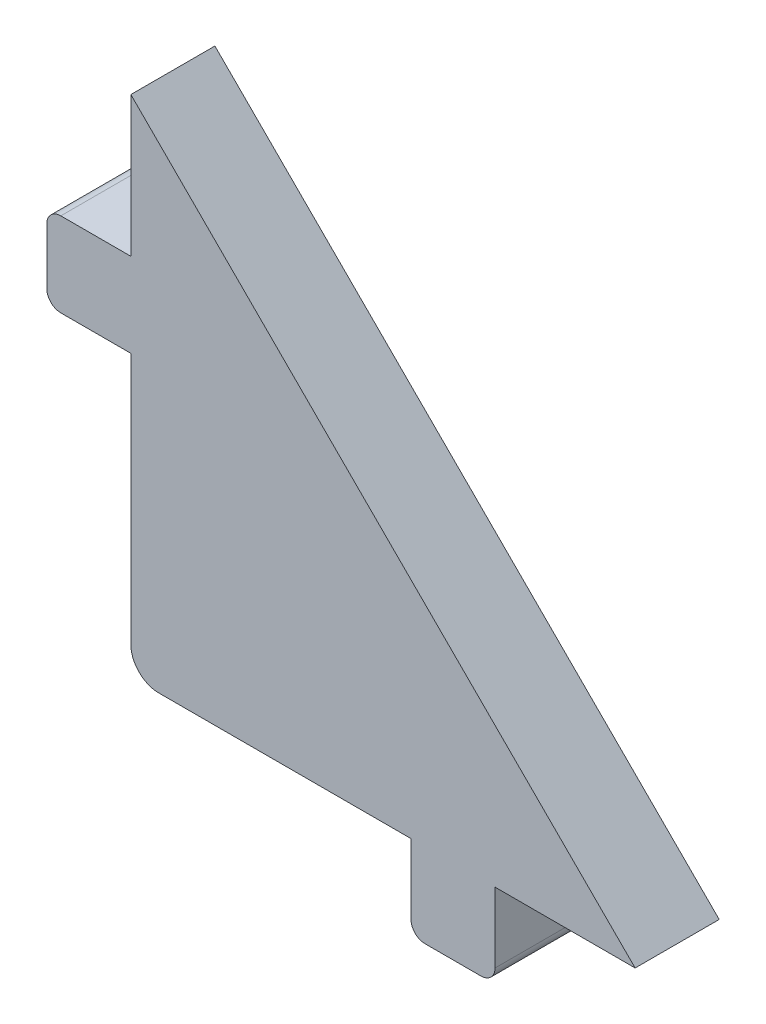
ISO-10303-21;
HEADER;
FILE_DESCRIPTION(('STEP AP214'),'2;1');
FILE_NAME('part.step','',(''),(''),'','','');
FILE_SCHEMA(('AUTOMOTIVE_DESIGN { 1 0 10303 214 1 1 1 1 }'));
ENDSEC;
DATA;
#1=APPLICATION_CONTEXT('core data for automotive mechanical design processes');
#2=APPLICATION_PROTOCOL_DEFINITION('international standard','automotive_design',2000,#1);
#3=PRODUCT_CONTEXT('',#1,'mechanical');
#4=PRODUCT('Part','Part','',(#3));
#5=PRODUCT_RELATED_PRODUCT_CATEGORY('part','',(#4));
#6=PRODUCT_DEFINITION_FORMATION('','',#4);
#7=PRODUCT_DEFINITION_CONTEXT('part definition',#1,'design');
#8=PRODUCT_DEFINITION('design','',#6,#7);
#9=PRODUCT_DEFINITION_SHAPE('','',#8);
#10=(LENGTH_UNIT() NAMED_UNIT(*) SI_UNIT(.MILLI.,.METRE.));
#11=(NAMED_UNIT(*) PLANE_ANGLE_UNIT() SI_UNIT($,.RADIAN.));
#12=(NAMED_UNIT(*) SI_UNIT($,.STERADIAN.) SOLID_ANGLE_UNIT());
#13=UNCERTAINTY_MEASURE_WITH_UNIT(LENGTH_MEASURE(1.E-05),#10,'distance_accuracy_value','');
#14=(GEOMETRIC_REPRESENTATION_CONTEXT(3) GLOBAL_UNCERTAINTY_ASSIGNED_CONTEXT((#13)) GLOBAL_UNIT_ASSIGNED_CONTEXT((#10,
#11,#12)) REPRESENTATION_CONTEXT('',''));
#15=CARTESIAN_POINT('',(0.,0.,0.));
#16=DIRECTION('',(0.,0.,1.));
#17=DIRECTION('',(1.,0.,0.));
#18=AXIS2_PLACEMENT_3D('',#15,#16,#17);
#19=CARTESIAN_POINT('',(0.,0.,3.));
#20=DIRECTION('',(0.,-1.,0.));
#21=DIRECTION('',(1.,0.,0.));
#22=AXIS2_PLACEMENT_3D('',#19,#20,#21);
#23=PLANE('',#22);
#24=DIRECTION('',(-1.,0.,0.));
#25=VECTOR('',#24,1.);
#26=CARTESIAN_POINT('',(0.,0.,3.));
#27=LINE('',#26,#25);
#28=CARTESIAN_POINT('',(3.,0.,3.));
#29=VERTEX_POINT('',#28);
#30=CARTESIAN_POINT('',(0.5,0.,3.));
#31=VERTEX_POINT('',#30);
#32=EDGE_CURVE('E160',#29,#31,#27,.T.);
#33=ORIENTED_EDGE('',*,*,#32,.T.);
#34=DIRECTION('',(0.,0.,-1.));
#35=VECTOR('',#34,1.);
#36=CARTESIAN_POINT('',(0.5,0.,3.));
#37=LINE('',#36,#35);
#38=CARTESIAN_POINT('',(0.5,0.,0.));
#39=VERTEX_POINT('',#38);
#40=EDGE_CURVE('E297',#31,#39,#37,.T.);
#41=ORIENTED_EDGE('',*,*,#40,.T.);
#42=DIRECTION('',(-1.,0.,0.));
#43=VECTOR('',#42,1.);
#44=CARTESIAN_POINT('',(0.,0.,0.));
#45=LINE('',#44,#43);
#46=CARTESIAN_POINT('',(3.,0.,0.));
#47=VERTEX_POINT('',#46);
#48=EDGE_CURVE('E167',#47,#39,#45,.T.);
#49=ORIENTED_EDGE('',*,*,#48,.F.);
#50=DIRECTION('',(0.,0.,-1.));
#51=VECTOR('',#50,1.);
#52=CARTESIAN_POINT('',(3.,0.,3.));
#53=LINE('',#52,#51);
#54=EDGE_CURVE('E153',#29,#47,#53,.T.);
#55=ORIENTED_EDGE('',*,*,#54,.F.);
#56=EDGE_LOOP('',(#33,#41,#49,#55));
#57=FACE_BOUND('',#56,.T.);
#58=ADVANCED_FACE('F40',(#57),#23,.T.);
#59=CARTESIAN_POINT('',(3.,0.,3.));
#60=DIRECTION('',(-1.,0.,0.));
#61=DIRECTION('',(0.,0.,1.));
#62=AXIS2_PLACEMENT_3D('',#59,#60,#61);
#63=PLANE('',#62);
#64=DIRECTION('',(0.,1.,0.));
#65=VECTOR('',#64,1.);
#66=CARTESIAN_POINT('',(3.,0.,0.));
#67=LINE('',#66,#65);
#68=CARTESIAN_POINT('',(3.,-9.,0.));
#69=VERTEX_POINT('',#68);
#70=EDGE_CURVE('E219',#69,#47,#67,.T.);
#71=ORIENTED_EDGE('',*,*,#70,.F.);
#72=DIRECTION('',(0.,0.,-1.));
#73=VECTOR('',#72,1.);
#74=CARTESIAN_POINT('',(3.,-9.,3.));
#75=LINE('',#74,#73);
#76=CARTESIAN_POINT('',(3.,-9.,3.));
#77=VERTEX_POINT('',#76);
#78=EDGE_CURVE('E49',#69,#77,#75,.F.);
#79=ORIENTED_EDGE('',*,*,#78,.T.);
#80=DIRECTION('',(0.,1.,0.));
#81=VECTOR('',#80,1.);
#82=CARTESIAN_POINT('',(3.,0.,3.));
#83=LINE('',#82,#81);
#84=EDGE_CURVE('E150',#77,#29,#83,.T.);
#85=ORIENTED_EDGE('',*,*,#84,.T.);
#86=ORIENTED_EDGE('',*,*,#54,.T.);
#87=EDGE_LOOP('',(#71,#79,#85,#86));
#88=FACE_BOUND('',#87,.T.);
#89=ADVANCED_FACE('F152',(#88),#63,.T.);
#90=CARTESIAN_POINT('',(0.,-10.,3.));
#91=DIRECTION('',(0.,-1.,0.));
#92=DIRECTION('',(0.,0.,-1.));
#93=AXIS2_PLACEMENT_3D('',#90,#91,#92);
#94=PLANE('',#93);
#95=DIRECTION('',(-1.,0.,0.));
#96=VECTOR('',#95,1.);
#97=CARTESIAN_POINT('',(0.,-10.,3.));
#98=LINE('',#97,#96);
#99=CARTESIAN_POINT('',(13.,-10.,3.));
#100=VERTEX_POINT('',#99);
#101=CARTESIAN_POINT('',(4.,-10.,3.));
#102=VERTEX_POINT('',#101);
#103=EDGE_CURVE('E159',#100,#102,#98,.T.);
#104=ORIENTED_EDGE('',*,*,#103,.T.);
#105=DIRECTION('',(0.,0.,-1.));
#106=VECTOR('',#105,1.);
#107=CARTESIAN_POINT('',(4.,-10.,3.));
#108=LINE('',#107,#106);
#109=CARTESIAN_POINT('',(4.,-10.,0.));
#110=VERTEX_POINT('',#109);
#111=EDGE_CURVE('E314',#102,#110,#108,.T.);
#112=ORIENTED_EDGE('',*,*,#111,.T.);
#113=DIRECTION('',(-1.,0.,0.));
#114=VECTOR('',#113,1.);
#115=CARTESIAN_POINT('',(0.,-10.,0.));
#116=LINE('',#115,#114);
#117=CARTESIAN_POINT('',(13.,-10.,0.));
#118=VERTEX_POINT('',#117);
#119=EDGE_CURVE('E222',#118,#110,#116,.T.);
#120=ORIENTED_EDGE('',*,*,#119,.F.);
#121=DIRECTION('',(0.,0.,-1.));
#122=VECTOR('',#121,1.);
#123=CARTESIAN_POINT('',(13.,-10.,3.));
#124=LINE('',#123,#122);
#125=EDGE_CURVE('E170',#100,#118,#124,.T.);
#126=ORIENTED_EDGE('',*,*,#125,.F.);
#127=EDGE_LOOP('',(#104,#112,#120,#126));
#128=FACE_BOUND('',#127,.T.);
#129=ADVANCED_FACE('F323',(#128),#94,.T.);
#130=CARTESIAN_POINT('',(13.,0.,3.));
#131=DIRECTION('',(-1.,0.,0.));
#132=DIRECTION('',(0.,0.,1.));
#133=AXIS2_PLACEMENT_3D('',#130,#131,#132);
#134=PLANE('',#133);
#135=DIRECTION('',(0.,1.,0.));
#136=VECTOR('',#135,1.);
#137=CARTESIAN_POINT('',(13.,0.,0.));
#138=LINE('',#137,#136);
#139=CARTESIAN_POINT('',(13.,-12.5,0.));
#140=VERTEX_POINT('',#139);
#141=EDGE_CURVE('E225',#140,#118,#138,.T.);
#142=ORIENTED_EDGE('',*,*,#141,.F.);
#143=DIRECTION('',(0.,0.,-1.));
#144=VECTOR('',#143,1.);
#145=CARTESIAN_POINT('',(13.,-12.5,3.));
#146=LINE('',#145,#144);
#147=CARTESIAN_POINT('',(13.,-12.5,3.));
#148=VERTEX_POINT('',#147);
#149=EDGE_CURVE('E307',#140,#148,#146,.F.);
#150=ORIENTED_EDGE('',*,*,#149,.T.);
#151=DIRECTION('',(0.,1.,0.));
#152=VECTOR('',#151,1.);
#153=CARTESIAN_POINT('',(13.,0.,3.));
#154=LINE('',#153,#152);
#155=EDGE_CURVE('E187',#148,#100,#154,.T.);
#156=ORIENTED_EDGE('',*,*,#155,.T.);
#157=ORIENTED_EDGE('',*,*,#125,.T.);
#158=EDGE_LOOP('',(#142,#150,#156,#157));
#159=FACE_BOUND('',#158,.T.);
#160=ADVANCED_FACE('F331',(#159),#134,.T.);
#161=CARTESIAN_POINT('',(0.,-13.,3.));
#162=DIRECTION('',(0.,-1.,0.));
#163=DIRECTION('',(0.,0.,-1.));
#164=AXIS2_PLACEMENT_3D('',#161,#162,#163);
#165=PLANE('',#164);
#166=DIRECTION('',(-1.,0.,0.));
#167=VECTOR('',#166,1.);
#168=CARTESIAN_POINT('',(0.,-13.,3.));
#169=LINE('',#168,#167);
#170=CARTESIAN_POINT('',(15.5,-13.,3.));
#171=VERTEX_POINT('',#170);
#172=CARTESIAN_POINT('',(13.5,-13.,3.));
#173=VERTEX_POINT('',#172);
#174=EDGE_CURVE('E190',#171,#173,#169,.T.);
#175=ORIENTED_EDGE('',*,*,#174,.T.);
#176=DIRECTION('',(0.,0.,-1.));
#177=VECTOR('',#176,1.);
#178=CARTESIAN_POINT('',(13.5,-13.,3.));
#179=LINE('',#178,#177);
#180=CARTESIAN_POINT('',(13.5,-13.,0.));
#181=VERTEX_POINT('',#180);
#182=EDGE_CURVE('E303',#173,#181,#179,.T.);
#183=ORIENTED_EDGE('',*,*,#182,.T.);
#184=DIRECTION('',(-1.,0.,0.));
#185=VECTOR('',#184,1.);
#186=CARTESIAN_POINT('',(0.,-13.,0.));
#187=LINE('',#186,#185);
#188=CARTESIAN_POINT('',(15.5,-13.,0.));
#189=VERTEX_POINT('',#188);
#190=EDGE_CURVE('E228',#189,#181,#187,.T.);
#191=ORIENTED_EDGE('',*,*,#190,.F.);
#192=DIRECTION('',(0.,0.,-1.));
#193=VECTOR('',#192,1.);
#194=CARTESIAN_POINT('',(15.5,-13.,3.));
#195=LINE('',#194,#193);
#196=EDGE_CURVE('E300',#189,#171,#195,.F.);
#197=ORIENTED_EDGE('',*,*,#196,.T.);
#198=EDGE_LOOP('',(#175,#183,#191,#197));
#199=FACE_BOUND('',#198,.T.);
#200=ADVANCED_FACE('F366',(#199),#165,.T.);
#201=CARTESIAN_POINT('',(16.,0.,3.));
#202=DIRECTION('',(1.,0.,0.));
#203=DIRECTION('',(0.,1.,0.));
#204=AXIS2_PLACEMENT_3D('',#201,#202,#203);
#205=PLANE('',#204);
#206=DIRECTION('',(0.,-1.,0.));
#207=VECTOR('',#206,1.);
#208=CARTESIAN_POINT('',(16.,0.,3.));
#209=LINE('',#208,#207);
#210=CARTESIAN_POINT('',(16.,-10.,3.));
#211=VERTEX_POINT('',#210);
#212=CARTESIAN_POINT('',(16.,-12.5,3.));
#213=VERTEX_POINT('',#212);
#214=EDGE_CURVE('E194',#211,#213,#209,.T.);
#215=ORIENTED_EDGE('',*,*,#214,.T.);
#216=DIRECTION('',(0.,0.,-1.));
#217=VECTOR('',#216,1.);
#218=CARTESIAN_POINT('',(16.,-12.5,3.));
#219=LINE('',#218,#217);
#220=CARTESIAN_POINT('',(16.,-12.5,0.));
#221=VERTEX_POINT('',#220);
#222=EDGE_CURVE('E310',#213,#221,#219,.T.);
#223=ORIENTED_EDGE('',*,*,#222,.T.);
#224=DIRECTION('',(0.,-1.,0.));
#225=VECTOR('',#224,1.);
#226=CARTESIAN_POINT('',(16.,0.,0.));
#227=LINE('',#226,#225);
#228=CARTESIAN_POINT('',(16.,-10.,0.));
#229=VERTEX_POINT('',#228);
#230=EDGE_CURVE('E232',#229,#221,#227,.T.);
#231=ORIENTED_EDGE('',*,*,#230,.F.);
#232=DIRECTION('',(0.,0.,-1.));
#233=VECTOR('',#232,1.);
#234=CARTESIAN_POINT('',(16.,-10.,3.));
#235=LINE('',#234,#233);
#236=EDGE_CURVE('E259',#211,#229,#235,.T.);
#237=ORIENTED_EDGE('',*,*,#236,.F.);
#238=EDGE_LOOP('',(#215,#223,#231,#237));
#239=FACE_BOUND('',#238,.T.);
#240=ADVANCED_FACE('F372',(#239),#205,.T.);
#241=CARTESIAN_POINT('',(0.,-10.,3.));
#242=DIRECTION('',(0.,1.,0.));
#243=DIRECTION('',(0.,0.,1.));
#244=AXIS2_PLACEMENT_3D('',#241,#242,#243);
#245=PLANE('',#244);
#246=DIRECTION('',(1.,0.,0.));
#247=VECTOR('',#246,1.);
#248=CARTESIAN_POINT('',(0.,-10.,0.));
#249=LINE('',#248,#247);
#250=CARTESIAN_POINT('',(21.0000000000002,-10.,0.));
#251=VERTEX_POINT('',#250);
#252=EDGE_CURVE('E236',#229,#251,#249,.T.);
#253=ORIENTED_EDGE('',*,*,#252,.T.);
#254=DIRECTION('',(0.,0.,-1.));
#255=VECTOR('',#254,1.);
#256=CARTESIAN_POINT('',(21.0000000000002,-10.,3.));
#257=LINE('',#256,#255);
#258=CARTESIAN_POINT('',(21.0000000000002,-10.,3.));
#259=VERTEX_POINT('',#258);
#260=EDGE_CURVE('E256',#259,#251,#257,.T.);
#261=ORIENTED_EDGE('',*,*,#260,.F.);
#262=DIRECTION('',(1.,0.,0.));
#263=VECTOR('',#262,1.);
#264=CARTESIAN_POINT('',(0.,-10.,3.));
#265=LINE('',#264,#263);
#266=EDGE_CURVE('E198',#211,#259,#265,.T.);
#267=ORIENTED_EDGE('',*,*,#266,.F.);
#268=ORIENTED_EDGE('',*,*,#236,.T.);
#269=EDGE_LOOP('',(#253,#261,#267,#268));
#270=FACE_BOUND('',#269,.T.);
#271=ADVANCED_FACE('F378',(#270),#245,.F.);
#272=CARTESIAN_POINT('',(5.49999999999998,5.50000000000005,3.));
#273=DIRECTION('',(0.707106781186544,0.707106781186551,0.));
#274=DIRECTION('',(-0.707106781186551,0.707106781186544,0.));
#275=AXIS2_PLACEMENT_3D('',#272,#273,#274);
#276=PLANE('',#275);
#277=DIRECTION('',(0.707106781186552,-0.707106781186544,0.));
#278=VECTOR('',#277,1.);
#279=CARTESIAN_POINT('',(5.49999999999998,5.50000000000005,0.));
#280=LINE('',#279,#278);
#281=CARTESIAN_POINT('',(3.,8.,0.));
#282=VERTEX_POINT('',#281);
#283=EDGE_CURVE('E240',#282,#251,#280,.T.);
#284=ORIENTED_EDGE('',*,*,#283,.F.);
#285=DIRECTION('',(0.,0.,-1.));
#286=VECTOR('',#285,1.);
#287=CARTESIAN_POINT('',(3.,8.,3.));
#288=LINE('',#287,#286);
#289=CARTESIAN_POINT('',(3.,8.,3.));
#290=VERTEX_POINT('',#289);
#291=EDGE_CURVE('E253',#290,#282,#288,.T.);
#292=ORIENTED_EDGE('',*,*,#291,.F.);
#293=DIRECTION('',(0.707106781186552,-0.707106781186544,0.));
#294=VECTOR('',#293,1.);
#295=CARTESIAN_POINT('',(5.49999999999998,5.50000000000005,3.));
#296=LINE('',#295,#294);
#297=EDGE_CURVE('E201',#290,#259,#296,.T.);
#298=ORIENTED_EDGE('',*,*,#297,.T.);
#299=ORIENTED_EDGE('',*,*,#260,.T.);
#300=EDGE_LOOP('',(#284,#292,#298,#299));
#301=FACE_BOUND('',#300,.T.);
#302=ADVANCED_FACE('F385',(#301),#276,.T.);
#303=CARTESIAN_POINT('',(3.,0.,3.));
#304=DIRECTION('',(1.,0.,0.));
#305=DIRECTION('',(0.,1.,0.));
#306=AXIS2_PLACEMENT_3D('',#303,#304,#305);
#307=PLANE('',#306);
#308=DIRECTION('',(0.,-1.,0.));
#309=VECTOR('',#308,1.);
#310=CARTESIAN_POINT('',(3.,0.,0.));
#311=LINE('',#310,#309);
#312=CARTESIAN_POINT('',(3.,3.,0.));
#313=VERTEX_POINT('',#312);
#314=EDGE_CURVE('E244',#282,#313,#311,.T.);
#315=ORIENTED_EDGE('',*,*,#314,.T.);
#316=DIRECTION('',(0.,0.,-1.));
#317=VECTOR('',#316,1.);
#318=CARTESIAN_POINT('',(3.,3.,3.));
#319=LINE('',#318,#317);
#320=CARTESIAN_POINT('',(3.,3.,3.));
#321=VERTEX_POINT('',#320);
#322=EDGE_CURVE('E216',#321,#313,#319,.T.);
#323=ORIENTED_EDGE('',*,*,#322,.F.);
#324=DIRECTION('',(0.,-1.,0.));
#325=VECTOR('',#324,1.);
#326=CARTESIAN_POINT('',(3.,0.,3.));
#327=LINE('',#326,#325);
#328=EDGE_CURVE('E205',#290,#321,#327,.T.);
#329=ORIENTED_EDGE('',*,*,#328,.F.);
#330=ORIENTED_EDGE('',*,*,#291,.T.);
#331=EDGE_LOOP('',(#315,#323,#329,#330));
#332=FACE_BOUND('',#331,.T.);
#333=ADVANCED_FACE('F388',(#332),#307,.F.);
#334=CARTESIAN_POINT('',(0.,3.,3.));
#335=DIRECTION('',(0.,1.,0.));
#336=DIRECTION('',(0.,0.,1.));
#337=AXIS2_PLACEMENT_3D('',#334,#335,#336);
#338=PLANE('',#337);
#339=DIRECTION('',(1.,0.,0.));
#340=VECTOR('',#339,1.);
#341=CARTESIAN_POINT('',(0.,3.,0.));
#342=LINE('',#341,#340);
#343=CARTESIAN_POINT('',(0.5,3.,0.));
#344=VERTEX_POINT('',#343);
#345=EDGE_CURVE('E181',#344,#313,#342,.T.);
#346=ORIENTED_EDGE('',*,*,#345,.F.);
#347=DIRECTION('',(0.,0.,-1.));
#348=VECTOR('',#347,1.);
#349=CARTESIAN_POINT('',(0.5,3.,3.));
#350=LINE('',#349,#348);
#351=CARTESIAN_POINT('',(0.5,3.,3.));
#352=VERTEX_POINT('',#351);
#353=EDGE_CURVE('E283',#344,#352,#350,.F.);
#354=ORIENTED_EDGE('',*,*,#353,.T.);
#355=DIRECTION('',(1.,0.,0.));
#356=VECTOR('',#355,1.);
#357=CARTESIAN_POINT('',(0.,3.,3.));
#358=LINE('',#357,#356);
#359=EDGE_CURVE('E209',#352,#321,#358,.T.);
#360=ORIENTED_EDGE('',*,*,#359,.T.);
#361=ORIENTED_EDGE('',*,*,#322,.T.);
#362=EDGE_LOOP('',(#346,#354,#360,#361));
#363=FACE_BOUND('',#362,.T.);
#364=ADVANCED_FACE('F391',(#363),#338,.T.);
#365=CARTESIAN_POINT('',(0.,0.,3.));
#366=DIRECTION('',(-1.,0.,0.));
#367=DIRECTION('',(0.,0.,1.));
#368=AXIS2_PLACEMENT_3D('',#365,#366,#367);
#369=PLANE('',#368);
#370=DIRECTION('',(0.,1.,0.));
#371=VECTOR('',#370,1.);
#372=CARTESIAN_POINT('',(0.,0.,3.));
#373=LINE('',#372,#371);
#374=CARTESIAN_POINT('',(0.,0.5,3.));
#375=VERTEX_POINT('',#374);
#376=CARTESIAN_POINT('',(0.,2.5,3.));
#377=VERTEX_POINT('',#376);
#378=EDGE_CURVE('E212',#375,#377,#373,.T.);
#379=ORIENTED_EDGE('',*,*,#378,.T.);
#380=DIRECTION('',(0.,0.,-1.));
#381=VECTOR('',#380,1.);
#382=CARTESIAN_POINT('',(0.,2.5,3.));
#383=LINE('',#382,#381);
#384=CARTESIAN_POINT('',(0.,2.5,0.));
#385=VERTEX_POINT('',#384);
#386=EDGE_CURVE('E267',#377,#385,#383,.T.);
#387=ORIENTED_EDGE('',*,*,#386,.T.);
#388=DIRECTION('',(0.,1.,0.));
#389=VECTOR('',#388,1.);
#390=CARTESIAN_POINT('',(0.,0.,0.));
#391=LINE('',#390,#389);
#392=CARTESIAN_POINT('',(0.,0.5,0.));
#393=VERTEX_POINT('',#392);
#394=EDGE_CURVE('E177',#393,#385,#391,.T.);
#395=ORIENTED_EDGE('',*,*,#394,.F.);
#396=DIRECTION('',(0.,0.,-1.));
#397=VECTOR('',#396,1.);
#398=CARTESIAN_POINT('',(0.,0.5,3.));
#399=LINE('',#398,#397);
#400=EDGE_CURVE('E169',#393,#375,#399,.F.);
#401=ORIENTED_EDGE('',*,*,#400,.T.);
#402=EDGE_LOOP('',(#379,#387,#395,#401));
#403=FACE_BOUND('',#402,.T.);
#404=ADVANCED_FACE('F397',(#403),#369,.T.);
#405=CARTESIAN_POINT('',(0.,0.,3.));
#406=DIRECTION('',(0.,0.,1.));
#407=DIRECTION('',(1.,0.,0.));
#408=AXIS2_PLACEMENT_3D('',#405,#406,#407);
#409=PLANE('',#408);
#410=ORIENTED_EDGE('',*,*,#84,.F.);
#411=CARTESIAN_POINT('',(4.,-9.,3.));
#412=DIRECTION('',(0.,0.,1.));
#413=DIRECTION('',(1.,0.,0.));
#414=AXIS2_PLACEMENT_3D('',#411,#412,#413);
#415=CIRCLE('',#414,1.);
#416=EDGE_CURVE('E11',#77,#102,#415,.T.);
#417=ORIENTED_EDGE('',*,*,#416,.T.);
#418=ORIENTED_EDGE('',*,*,#103,.F.);
#419=ORIENTED_EDGE('',*,*,#155,.F.);
#420=CARTESIAN_POINT('',(13.5,-12.5,3.));
#421=DIRECTION('',(0.,0.,1.));
#422=DIRECTION('',(1.,0.,0.));
#423=AXIS2_PLACEMENT_3D('',#420,#421,#422);
#424=CIRCLE('',#423,0.5);
#425=EDGE_CURVE('E289',#148,#173,#424,.T.);
#426=ORIENTED_EDGE('',*,*,#425,.T.);
#427=ORIENTED_EDGE('',*,*,#174,.F.);
#428=CARTESIAN_POINT('',(15.5,-12.5,3.));
#429=DIRECTION('',(0.,0.,1.));
#430=DIRECTION('',(1.,0.,0.));
#431=AXIS2_PLACEMENT_3D('',#428,#429,#430);
#432=CIRCLE('',#431,0.5);
#433=EDGE_CURVE('E286',#171,#213,#432,.T.);
#434=ORIENTED_EDGE('',*,*,#433,.T.);
#435=ORIENTED_EDGE('',*,*,#214,.F.);
#436=ORIENTED_EDGE('',*,*,#266,.T.);
#437=ORIENTED_EDGE('',*,*,#297,.F.);
#438=ORIENTED_EDGE('',*,*,#328,.T.);
#439=ORIENTED_EDGE('',*,*,#359,.F.);
#440=CARTESIAN_POINT('',(0.5,2.5,3.));
#441=DIRECTION('',(0.,0.,1.));
#442=DIRECTION('',(1.,0.,0.));
#443=AXIS2_PLACEMENT_3D('',#440,#441,#442);
#444=CIRCLE('',#443,0.5);
#445=EDGE_CURVE('E294',#352,#377,#444,.T.);
#446=ORIENTED_EDGE('',*,*,#445,.T.);
#447=ORIENTED_EDGE('',*,*,#378,.F.);
#448=CARTESIAN_POINT('',(0.5,0.5,3.));
#449=DIRECTION('',(0.,0.,1.));
#450=DIRECTION('',(1.,0.,0.));
#451=AXIS2_PLACEMENT_3D('',#448,#449,#450);
#452=CIRCLE('',#451,0.5);
#453=EDGE_CURVE('E175',#375,#31,#452,.T.);
#454=ORIENTED_EDGE('',*,*,#453,.T.);
#455=ORIENTED_EDGE('',*,*,#32,.F.);
#456=EDGE_LOOP('',(#410,#417,#418,#419,#426,#427,#434,#435,#436,#437,#438,#439,#446,#447,#454,#455));
#457=FACE_BOUND('',#456,.T.);
#458=ADVANCED_FACE('F172',(#457),#409,.T.);
#459=CARTESIAN_POINT('',(0.,0.,0.));
#460=DIRECTION('',(0.,0.,1.));
#461=DIRECTION('',(1.,0.,0.));
#462=AXIS2_PLACEMENT_3D('',#459,#460,#461);
#463=PLANE('',#462);
#464=ORIENTED_EDGE('',*,*,#119,.T.);
#465=CARTESIAN_POINT('',(4.,-9.,0.));
#466=DIRECTION('',(0.,0.,1.));
#467=DIRECTION('',(1.,0.,0.));
#468=AXIS2_PLACEMENT_3D('',#465,#466,#467);
#469=CIRCLE('',#468,1.);
#470=EDGE_CURVE('E63',#110,#69,#469,.F.);
#471=ORIENTED_EDGE('',*,*,#470,.T.);
#472=ORIENTED_EDGE('',*,*,#70,.T.);
#473=ORIENTED_EDGE('',*,*,#48,.T.);
#474=CARTESIAN_POINT('',(0.5,0.5,0.));
#475=DIRECTION('',(0.,0.,1.));
#476=DIRECTION('',(1.,0.,0.));
#477=AXIS2_PLACEMENT_3D('',#474,#475,#476);
#478=CIRCLE('',#477,0.5);
#479=EDGE_CURVE('E277',#39,#393,#478,.F.);
#480=ORIENTED_EDGE('',*,*,#479,.T.);
#481=ORIENTED_EDGE('',*,*,#394,.T.);
#482=CARTESIAN_POINT('',(0.5,2.5,0.));
#483=DIRECTION('',(0.,0.,1.));
#484=DIRECTION('',(1.,0.,0.));
#485=AXIS2_PLACEMENT_3D('',#482,#483,#484);
#486=CIRCLE('',#485,0.5);
#487=EDGE_CURVE('E280',#385,#344,#486,.F.);
#488=ORIENTED_EDGE('',*,*,#487,.T.);
#489=ORIENTED_EDGE('',*,*,#345,.T.);
#490=ORIENTED_EDGE('',*,*,#314,.F.);
#491=ORIENTED_EDGE('',*,*,#283,.T.);
#492=ORIENTED_EDGE('',*,*,#252,.F.);
#493=ORIENTED_EDGE('',*,*,#230,.T.);
#494=CARTESIAN_POINT('',(15.5,-12.5,0.));
#495=DIRECTION('',(0.,0.,1.));
#496=DIRECTION('',(1.,0.,0.));
#497=AXIS2_PLACEMENT_3D('',#494,#495,#496);
#498=CIRCLE('',#497,0.5);
#499=EDGE_CURVE('E271',#221,#189,#498,.F.);
#500=ORIENTED_EDGE('',*,*,#499,.T.);
#501=ORIENTED_EDGE('',*,*,#190,.T.);
#502=CARTESIAN_POINT('',(13.5,-12.5,0.));
#503=DIRECTION('',(0.,0.,1.));
#504=DIRECTION('',(1.,0.,0.));
#505=AXIS2_PLACEMENT_3D('',#502,#503,#504);
#506=CIRCLE('',#505,0.5);
#507=EDGE_CURVE('E274',#181,#140,#506,.F.);
#508=ORIENTED_EDGE('',*,*,#507,.T.);
#509=ORIENTED_EDGE('',*,*,#141,.T.);
#510=EDGE_LOOP('',(#464,#471,#472,#473,#480,#481,#488,#489,#490,#491,#492,#493,#500,#501,#508,#509));
#511=FACE_BOUND('',#510,.T.);
#512=ADVANCED_FACE('F327',(#511),#463,.F.);
#513=CARTESIAN_POINT('',(0.5,2.5,3.));
#514=DIRECTION('',(0.,0.,-1.));
#515=DIRECTION('',(-1.,0.,0.));
#516=AXIS2_PLACEMENT_3D('',#513,#514,#515);
#517=CYLINDRICAL_SURFACE('',#516,0.5);
#518=ORIENTED_EDGE('',*,*,#445,.F.);
#519=ORIENTED_EDGE('',*,*,#353,.F.);
#520=ORIENTED_EDGE('',*,*,#487,.F.);
#521=ORIENTED_EDGE('',*,*,#386,.F.);
#522=EDGE_LOOP('',(#518,#519,#520,#521));
#523=FACE_BOUND('',#522,.T.);
#524=ADVANCED_FACE('F350',(#523),#517,.T.);
#525=CARTESIAN_POINT('',(0.5,0.5,3.));
#526=DIRECTION('',(0.,0.,-1.));
#527=DIRECTION('',(-1.,0.,0.));
#528=AXIS2_PLACEMENT_3D('',#525,#526,#527);
#529=CYLINDRICAL_SURFACE('',#528,0.5);
#530=ORIENTED_EDGE('',*,*,#453,.F.);
#531=ORIENTED_EDGE('',*,*,#400,.F.);
#532=ORIENTED_EDGE('',*,*,#479,.F.);
#533=ORIENTED_EDGE('',*,*,#40,.F.);
#534=EDGE_LOOP('',(#530,#531,#532,#533));
#535=FACE_BOUND('',#534,.T.);
#536=ADVANCED_FACE('F353',(#535),#529,.T.);
#537=CARTESIAN_POINT('',(13.5,-12.5,3.));
#538=DIRECTION('',(0.,0.,-1.));
#539=DIRECTION('',(-1.,0.,0.));
#540=AXIS2_PLACEMENT_3D('',#537,#538,#539);
#541=CYLINDRICAL_SURFACE('',#540,0.5);
#542=ORIENTED_EDGE('',*,*,#425,.F.);
#543=ORIENTED_EDGE('',*,*,#149,.F.);
#544=ORIENTED_EDGE('',*,*,#507,.F.);
#545=ORIENTED_EDGE('',*,*,#182,.F.);
#546=EDGE_LOOP('',(#542,#543,#544,#545));
#547=FACE_BOUND('',#546,.T.);
#548=ADVANCED_FACE('F339',(#547),#541,.T.);
#549=CARTESIAN_POINT('',(15.5,-12.5,3.));
#550=DIRECTION('',(0.,0.,-1.));
#551=DIRECTION('',(-1.,0.,0.));
#552=AXIS2_PLACEMENT_3D('',#549,#550,#551);
#553=CYLINDRICAL_SURFACE('',#552,0.5);
#554=ORIENTED_EDGE('',*,*,#433,.F.);
#555=ORIENTED_EDGE('',*,*,#196,.F.);
#556=ORIENTED_EDGE('',*,*,#499,.F.);
#557=ORIENTED_EDGE('',*,*,#222,.F.);
#558=EDGE_LOOP('',(#554,#555,#556,#557));
#559=FACE_BOUND('',#558,.T.);
#560=ADVANCED_FACE('F335',(#559),#553,.T.);
#561=CARTESIAN_POINT('',(4.,-9.,3.));
#562=DIRECTION('',(0.,0.,-1.));
#563=DIRECTION('',(-1.,0.,0.));
#564=AXIS2_PLACEMENT_3D('',#561,#562,#563);
#565=CYLINDRICAL_SURFACE('',#564,1.);
#566=ORIENTED_EDGE('',*,*,#416,.F.);
#567=ORIENTED_EDGE('',*,*,#78,.F.);
#568=ORIENTED_EDGE('',*,*,#470,.F.);
#569=ORIENTED_EDGE('',*,*,#111,.F.);
#570=EDGE_LOOP('',(#566,#567,#568,#569));
#571=FACE_BOUND('',#570,.T.);
#572=ADVANCED_FACE('F42',(#571),#565,.T.);
#573=CLOSED_SHELL('',(#58,#89,#129,#160,#200,#240,#271,#302,#333,#364,#404,#458,#512,#524,#536,
#548,#560,#572));
#574=MANIFOLD_SOLID_BREP('B2',#573);
#575=ADVANCED_BREP_SHAPE_REPRESENTATION('',(#18,#574),#14);
#576=SHAPE_DEFINITION_REPRESENTATION(#9,#575);
ENDSEC;
END-ISO-10303-21;
